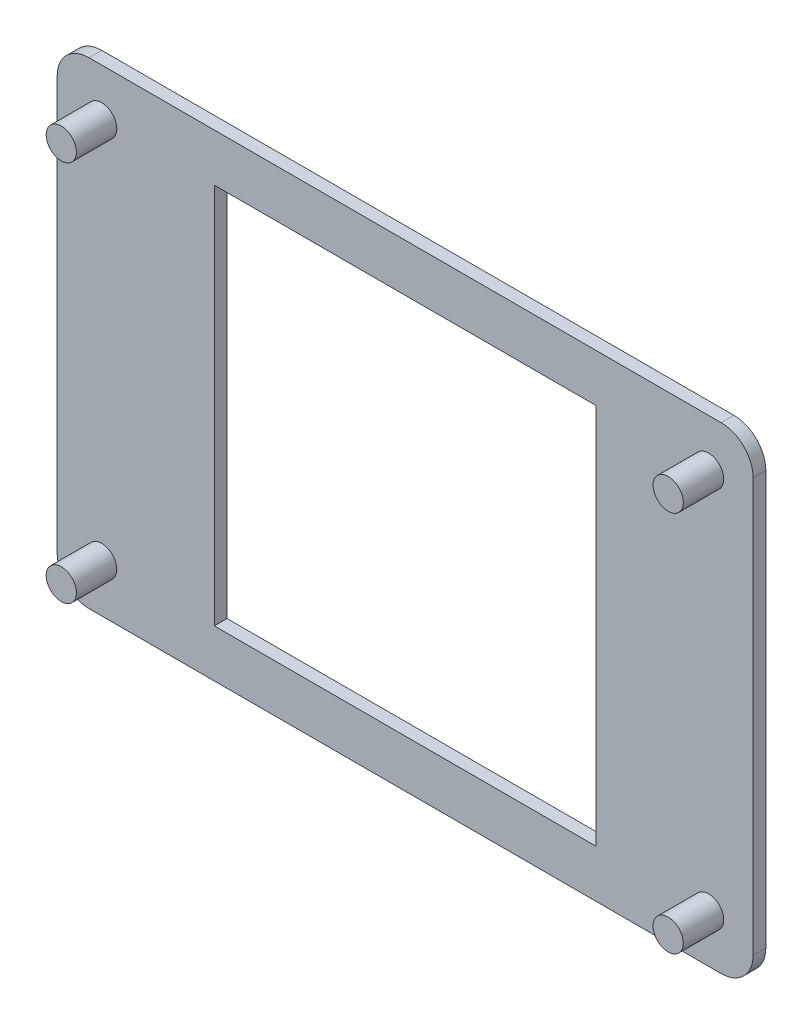
ISO-10303-21;
HEADER;
FILE_DESCRIPTION(('STEP AP214'),'2;1');
FILE_NAME('part.step','',(''),(''),'','','');
FILE_SCHEMA(('AUTOMOTIVE_DESIGN { 1 0 10303 214 1 1 1 1 }'));
ENDSEC;
DATA;
#1=APPLICATION_CONTEXT('core data for automotive mechanical design processes');
#2=APPLICATION_PROTOCOL_DEFINITION('international standard','automotive_design',2000,#1);
#3=PRODUCT_CONTEXT('',#1,'mechanical');
#4=PRODUCT('Part','Part','',(#3));
#5=PRODUCT_RELATED_PRODUCT_CATEGORY('part','',(#4));
#6=PRODUCT_DEFINITION_FORMATION('','',#4);
#7=PRODUCT_DEFINITION_CONTEXT('part definition',#1,'design');
#8=PRODUCT_DEFINITION('design','',#6,#7);
#9=PRODUCT_DEFINITION_SHAPE('','',#8);
#10=(LENGTH_UNIT() NAMED_UNIT(*) SI_UNIT(.MILLI.,.METRE.));
#11=(NAMED_UNIT(*) PLANE_ANGLE_UNIT() SI_UNIT($,.RADIAN.));
#12=(NAMED_UNIT(*) SI_UNIT($,.STERADIAN.) SOLID_ANGLE_UNIT());
#13=UNCERTAINTY_MEASURE_WITH_UNIT(LENGTH_MEASURE(1.E-05),#10,'distance_accuracy_value','');
#14=(GEOMETRIC_REPRESENTATION_CONTEXT(3) GLOBAL_UNCERTAINTY_ASSIGNED_CONTEXT((#13)) GLOBAL_UNIT_ASSIGNED_CONTEXT((#10,
#11,#12)) REPRESENTATION_CONTEXT('',''));
#15=CARTESIAN_POINT('',(0.,0.,0.));
#16=DIRECTION('',(0.,0.,1.));
#17=DIRECTION('',(1.,0.,0.));
#18=AXIS2_PLACEMENT_3D('',#15,#16,#17);
#19=CARTESIAN_POINT('',(0.,0.,2.));
#20=DIRECTION('',(1.,0.,0.));
#21=DIRECTION('',(0.,0.,-1.));
#22=AXIS2_PLACEMENT_3D('',#19,#20,#21);
#23=PLANE('',#22);
#24=DIRECTION('',(0.,-1.,0.));
#25=VECTOR('',#24,1.);
#26=CARTESIAN_POINT('',(0.,0.,0.));
#27=LINE('',#26,#25);
#28=CARTESIAN_POINT('',(0.,70.,0.));
#29=VERTEX_POINT('',#28);
#30=CARTESIAN_POINT('',(0.,5.,0.));
#31=VERTEX_POINT('',#30);
#32=EDGE_CURVE('E177',#29,#31,#27,.T.);
#33=ORIENTED_EDGE('',*,*,#32,.T.);
#34=DIRECTION('',(0.,0.,-1.));
#35=VECTOR('',#34,1.);
#36=CARTESIAN_POINT('',(0.,5.,2.));
#37=LINE('',#36,#35);
#38=CARTESIAN_POINT('',(0.,5.,2.));
#39=VERTEX_POINT('',#38);
#40=EDGE_CURVE('E11',#31,#39,#37,.F.);
#41=ORIENTED_EDGE('',*,*,#40,.T.);
#42=DIRECTION('',(0.,-1.,0.));
#43=VECTOR('',#42,1.);
#44=CARTESIAN_POINT('',(0.,0.,2.));
#45=LINE('',#44,#43);
#46=CARTESIAN_POINT('',(0.,70.,2.));
#47=VERTEX_POINT('',#46);
#48=EDGE_CURVE('E178',#47,#39,#45,.T.);
#49=ORIENTED_EDGE('',*,*,#48,.F.);
#50=DIRECTION('',(0.,0.,-1.));
#51=VECTOR('',#50,1.);
#52=CARTESIAN_POINT('',(0.,70.,2.));
#53=LINE('',#52,#51);
#54=EDGE_CURVE('E41',#47,#29,#53,.T.);
#55=ORIENTED_EDGE('',*,*,#54,.T.);
#56=EDGE_LOOP('',(#33,#41,#49,#55));
#57=FACE_BOUND('',#56,.T.);
#58=ADVANCED_FACE('F33',(#57),#23,.F.);
#59=CARTESIAN_POINT('',(0.,0.,2.));
#60=DIRECTION('',(0.,1.,0.));
#61=DIRECTION('',(0.,0.,1.));
#62=AXIS2_PLACEMENT_3D('',#59,#60,#61);
#63=PLANE('',#62);
#64=DIRECTION('',(1.,0.,0.));
#65=VECTOR('',#64,1.);
#66=CARTESIAN_POINT('',(0.,0.,0.));
#67=LINE('',#66,#65);
#68=CARTESIAN_POINT('',(5.,0.,0.));
#69=VERTEX_POINT('',#68);
#70=CARTESIAN_POINT('',(104.3978,0.,0.));
#71=VERTEX_POINT('',#70);
#72=EDGE_CURVE('E192',#69,#71,#67,.T.);
#73=ORIENTED_EDGE('',*,*,#72,.T.);
#74=DIRECTION('',(0.,0.,-1.));
#75=VECTOR('',#74,1.);
#76=CARTESIAN_POINT('',(104.3978,0.,2.));
#77=LINE('',#76,#75);
#78=CARTESIAN_POINT('',(104.3978,0.,2.));
#79=VERTEX_POINT('',#78);
#80=EDGE_CURVE('E48',#71,#79,#77,.F.);
#81=ORIENTED_EDGE('',*,*,#80,.T.);
#82=DIRECTION('',(1.,0.,0.));
#83=VECTOR('',#82,1.);
#84=CARTESIAN_POINT('',(0.,0.,2.));
#85=LINE('',#84,#83);
#86=CARTESIAN_POINT('',(5.,0.,2.));
#87=VERTEX_POINT('',#86);
#88=EDGE_CURVE('E180',#87,#79,#85,.T.);
#89=ORIENTED_EDGE('',*,*,#88,.F.);
#90=DIRECTION('',(0.,0.,-1.));
#91=VECTOR('',#90,1.);
#92=CARTESIAN_POINT('',(5.,0.,2.));
#93=LINE('',#92,#91);
#94=EDGE_CURVE('E235',#87,#69,#93,.T.);
#95=ORIENTED_EDGE('',*,*,#94,.T.);
#96=EDGE_LOOP('',(#73,#81,#89,#95));
#97=FACE_BOUND('',#96,.T.);
#98=ADVANCED_FACE('F251',(#97),#63,.F.);
#99=CARTESIAN_POINT('',(109.3978,0.,2.));
#100=DIRECTION('',(-1.,0.,0.));
#101=DIRECTION('',(0.,0.,1.));
#102=AXIS2_PLACEMENT_3D('',#99,#100,#101);
#103=PLANE('',#102);
#104=DIRECTION('',(0.,1.,0.));
#105=VECTOR('',#104,1.);
#106=CARTESIAN_POINT('',(109.3978,0.,0.));
#107=LINE('',#106,#105);
#108=CARTESIAN_POINT('',(109.3978,5.,0.));
#109=VERTEX_POINT('',#108);
#110=CARTESIAN_POINT('',(109.3978,70.,0.));
#111=VERTEX_POINT('',#110);
#112=EDGE_CURVE('E194',#109,#111,#107,.T.);
#113=ORIENTED_EDGE('',*,*,#112,.T.);
#114=DIRECTION('',(0.,0.,-1.));
#115=VECTOR('',#114,1.);
#116=CARTESIAN_POINT('',(109.3978,70.,2.));
#117=LINE('',#116,#115);
#118=CARTESIAN_POINT('',(109.3978,70.,2.));
#119=VERTEX_POINT('',#118);
#120=EDGE_CURVE('E226',#111,#119,#117,.F.);
#121=ORIENTED_EDGE('',*,*,#120,.T.);
#122=DIRECTION('',(0.,1.,0.));
#123=VECTOR('',#122,1.);
#124=CARTESIAN_POINT('',(109.3978,0.,2.));
#125=LINE('',#124,#123);
#126=CARTESIAN_POINT('',(109.3978,5.,2.));
#127=VERTEX_POINT('',#126);
#128=EDGE_CURVE('E183',#127,#119,#125,.T.);
#129=ORIENTED_EDGE('',*,*,#128,.F.);
#130=DIRECTION('',(0.,0.,-1.));
#131=VECTOR('',#130,1.);
#132=CARTESIAN_POINT('',(109.3978,5.,2.));
#133=LINE('',#132,#131);
#134=EDGE_CURVE('E223',#127,#109,#133,.T.);
#135=ORIENTED_EDGE('',*,*,#134,.T.);
#136=EDGE_LOOP('',(#113,#121,#129,#135));
#137=FACE_BOUND('',#136,.T.);
#138=ADVANCED_FACE('F260',(#137),#103,.F.);
#139=CARTESIAN_POINT('',(0.,75.,2.));
#140=DIRECTION('',(0.,-1.,0.));
#141=DIRECTION('',(0.,0.,-1.));
#142=AXIS2_PLACEMENT_3D('',#139,#140,#141);
#143=PLANE('',#142);
#144=DIRECTION('',(-1.,0.,0.));
#145=VECTOR('',#144,1.);
#146=CARTESIAN_POINT('',(0.,75.,2.));
#147=LINE('',#146,#145);
#148=CARTESIAN_POINT('',(104.3978,75.,2.));
#149=VERTEX_POINT('',#148);
#150=CARTESIAN_POINT('',(5.,75.,2.));
#151=VERTEX_POINT('',#150);
#152=EDGE_CURVE('E186',#149,#151,#147,.T.);
#153=ORIENTED_EDGE('',*,*,#152,.F.);
#154=DIRECTION('',(0.,0.,-1.));
#155=VECTOR('',#154,1.);
#156=CARTESIAN_POINT('',(104.3978,75.,2.));
#157=LINE('',#156,#155);
#158=CARTESIAN_POINT('',(104.3978,75.,0.));
#159=VERTEX_POINT('',#158);
#160=EDGE_CURVE('E212',#149,#159,#157,.T.);
#161=ORIENTED_EDGE('',*,*,#160,.T.);
#162=DIRECTION('',(-1.,0.,0.));
#163=VECTOR('',#162,1.);
#164=CARTESIAN_POINT('',(0.,75.,0.));
#165=LINE('',#164,#163);
#166=CARTESIAN_POINT('',(5.,75.,0.));
#167=VERTEX_POINT('',#166);
#168=EDGE_CURVE('E181',#159,#167,#165,.T.);
#169=ORIENTED_EDGE('',*,*,#168,.T.);
#170=DIRECTION('',(0.,0.,-1.));
#171=VECTOR('',#170,1.);
#172=CARTESIAN_POINT('',(5.,75.,2.));
#173=LINE('',#172,#171);
#174=EDGE_CURVE('E210',#167,#151,#173,.F.);
#175=ORIENTED_EDGE('',*,*,#174,.T.);
#176=EDGE_LOOP('',(#153,#161,#169,#175));
#177=FACE_BOUND('',#176,.T.);
#178=ADVANCED_FACE('F268',(#177),#143,.F.);
#179=CARTESIAN_POINT('',(0.,0.,2.));
#180=DIRECTION('',(0.,0.,-1.));
#181=DIRECTION('',(-1.,0.,0.));
#182=AXIS2_PLACEMENT_3D('',#179,#180,#181);
#183=PLANE('',#182);
#184=DIRECTION('',(-1.,0.,0.));
#185=VECTOR('',#184,1.);
#186=CARTESIAN_POINT('',(24.6989,67.5,2.));
#187=LINE('',#186,#185);
#188=CARTESIAN_POINT('',(84.6989,67.5,2.));
#189=VERTEX_POINT('',#188);
#190=CARTESIAN_POINT('',(24.6989,67.5,2.));
#191=VERTEX_POINT('',#190);
#192=EDGE_CURVE('E150',#189,#191,#187,.T.);
#193=ORIENTED_EDGE('',*,*,#192,.F.);
#194=DIRECTION('',(0.,1.,0.));
#195=VECTOR('',#194,1.);
#196=CARTESIAN_POINT('',(84.6989,7.50000000000001,2.));
#197=LINE('',#196,#195);
#198=CARTESIAN_POINT('',(84.6989,7.50000000000001,2.));
#199=VERTEX_POINT('',#198);
#200=EDGE_CURVE('E142',#199,#189,#197,.T.);
#201=ORIENTED_EDGE('',*,*,#200,.F.);
#202=DIRECTION('',(1.,0.,0.));
#203=VECTOR('',#202,1.);
#204=CARTESIAN_POINT('',(24.6989,7.50000000000001,2.));
#205=LINE('',#204,#203);
#206=CARTESIAN_POINT('',(24.6989,7.50000000000001,2.));
#207=VERTEX_POINT('',#206);
#208=EDGE_CURVE('E143',#207,#199,#205,.T.);
#209=ORIENTED_EDGE('',*,*,#208,.F.);
#210=DIRECTION('',(0.,-1.,0.));
#211=VECTOR('',#210,1.);
#212=CARTESIAN_POINT('',(24.6989,7.50000000000001,2.));
#213=LINE('',#212,#211);
#214=EDGE_CURVE('E157',#191,#207,#213,.T.);
#215=ORIENTED_EDGE('',*,*,#214,.F.);
#216=EDGE_LOOP('',(#193,#201,#209,#215));
#217=FACE_BOUND('',#216,.T.);
#218=CARTESIAN_POINT('',(6.9977,7.5026,2.));
#219=DIRECTION('',(0.,0.,-1.));
#220=DIRECTION('',(-1.,0.,0.));
#221=AXIS2_PLACEMENT_3D('',#218,#219,#220);
#222=CIRCLE('',#221,2.375);
#223=CARTESIAN_POINT('',(4.6227,7.5026,2.));
#224=VERTEX_POINT('',#223);
#225=EDGE_CURVE('E207',#224,#224,#222,.F.);
#226=ORIENTED_EDGE('',*,*,#225,.F.);
#227=EDGE_LOOP('',(#226));
#228=FACE_BOUND('',#227,.T.);
#229=CARTESIAN_POINT('',(102.4001,7.50260000000001,2.));
#230=DIRECTION('',(0.,0.,-1.));
#231=DIRECTION('',(-1.,0.,0.));
#232=AXIS2_PLACEMENT_3D('',#229,#230,#231);
#233=CIRCLE('',#232,2.375);
#234=CARTESIAN_POINT('',(100.0251,7.50260000000001,2.));
#235=VERTEX_POINT('',#234);
#236=EDGE_CURVE('E204',#235,#235,#233,.F.);
#237=ORIENTED_EDGE('',*,*,#236,.F.);
#238=EDGE_LOOP('',(#237));
#239=FACE_BOUND('',#238,.T.);
#240=CARTESIAN_POINT('',(102.4001,67.4974,2.));
#241=DIRECTION('',(0.,0.,-1.));
#242=DIRECTION('',(-1.,0.,0.));
#243=AXIS2_PLACEMENT_3D('',#240,#241,#242);
#244=CIRCLE('',#243,2.375);
#245=CARTESIAN_POINT('',(100.0251,67.4974,2.));
#246=VERTEX_POINT('',#245);
#247=EDGE_CURVE('E201',#246,#246,#244,.F.);
#248=ORIENTED_EDGE('',*,*,#247,.F.);
#249=EDGE_LOOP('',(#248));
#250=FACE_BOUND('',#249,.T.);
#251=CARTESIAN_POINT('',(6.9977,67.4974,2.));
#252=DIRECTION('',(0.,0.,-1.));
#253=DIRECTION('',(-1.,0.,0.));
#254=AXIS2_PLACEMENT_3D('',#251,#252,#253);
#255=CIRCLE('',#254,2.375);
#256=CARTESIAN_POINT('',(4.6227,67.4974,2.));
#257=VERTEX_POINT('',#256);
#258=EDGE_CURVE('E189',#257,#257,#255,.F.);
#259=ORIENTED_EDGE('',*,*,#258,.F.);
#260=EDGE_LOOP('',(#259));
#261=FACE_BOUND('',#260,.T.);
#262=ORIENTED_EDGE('',*,*,#128,.T.);
#263=CARTESIAN_POINT('',(104.3978,70.,2.));
#264=DIRECTION('',(0.,0.,-1.));
#265=DIRECTION('',(-1.,0.,0.));
#266=AXIS2_PLACEMENT_3D('',#263,#264,#265);
#267=CIRCLE('',#266,5.);
#268=EDGE_CURVE('E233',#119,#149,#267,.F.);
#269=ORIENTED_EDGE('',*,*,#268,.T.);
#270=ORIENTED_EDGE('',*,*,#152,.T.);
#271=CARTESIAN_POINT('',(5.,70.,2.));
#272=DIRECTION('',(0.,0.,-1.));
#273=DIRECTION('',(-1.,0.,0.));
#274=AXIS2_PLACEMENT_3D('',#271,#272,#273);
#275=CIRCLE('',#274,5.);
#276=EDGE_CURVE('E228',#151,#47,#275,.F.);
#277=ORIENTED_EDGE('',*,*,#276,.T.);
#278=ORIENTED_EDGE('',*,*,#48,.T.);
#279=CARTESIAN_POINT('',(5.,5.,2.));
#280=DIRECTION('',(0.,0.,-1.));
#281=DIRECTION('',(-1.,0.,0.));
#282=AXIS2_PLACEMENT_3D('',#279,#280,#281);
#283=CIRCLE('',#282,5.);
#284=EDGE_CURVE('E55',#39,#87,#283,.F.);
#285=ORIENTED_EDGE('',*,*,#284,.T.);
#286=ORIENTED_EDGE('',*,*,#88,.T.);
#287=CARTESIAN_POINT('',(104.3978,5.,2.));
#288=DIRECTION('',(0.,0.,-1.));
#289=DIRECTION('',(-1.,0.,0.));
#290=AXIS2_PLACEMENT_3D('',#287,#288,#289);
#291=CIRCLE('',#290,5.);
#292=EDGE_CURVE('E231',#79,#127,#291,.F.);
#293=ORIENTED_EDGE('',*,*,#292,.T.);
#294=EDGE_LOOP('',(#262,#269,#270,#277,#278,#285,#286,#293));
#295=FACE_BOUND('',#294,.T.);
#296=ADVANCED_FACE('F253',(#217,#228,#239,#250,#261,#295),#183,.F.);
#297=CARTESIAN_POINT('',(0.,0.,0.));
#298=DIRECTION('',(0.,0.,-1.));
#299=DIRECTION('',(-1.,0.,0.));
#300=AXIS2_PLACEMENT_3D('',#297,#298,#299);
#301=PLANE('',#300);
#302=DIRECTION('',(0.,1.,0.));
#303=VECTOR('',#302,1.);
#304=CARTESIAN_POINT('',(84.6989,7.50000000000001,0.));
#305=LINE('',#304,#303);
#306=CARTESIAN_POINT('',(84.6989,7.50000000000001,0.));
#307=VERTEX_POINT('',#306);
#308=CARTESIAN_POINT('',(84.6989,67.5,0.));
#309=VERTEX_POINT('',#308);
#310=EDGE_CURVE('E139',#307,#309,#305,.T.);
#311=ORIENTED_EDGE('',*,*,#310,.T.);
#312=DIRECTION('',(-1.,0.,0.));
#313=VECTOR('',#312,1.);
#314=CARTESIAN_POINT('',(24.6989,67.5,0.));
#315=LINE('',#314,#313);
#316=CARTESIAN_POINT('',(24.6989,67.5,0.));
#317=VERTEX_POINT('',#316);
#318=EDGE_CURVE('E123',#309,#317,#315,.T.);
#319=ORIENTED_EDGE('',*,*,#318,.T.);
#320=DIRECTION('',(0.,-1.,0.));
#321=VECTOR('',#320,1.);
#322=CARTESIAN_POINT('',(24.6989,7.50000000000001,0.));
#323=LINE('',#322,#321);
#324=CARTESIAN_POINT('',(24.6989,7.50000000000001,0.));
#325=VERTEX_POINT('',#324);
#326=EDGE_CURVE('E152',#317,#325,#323,.T.);
#327=ORIENTED_EDGE('',*,*,#326,.T.);
#328=DIRECTION('',(1.,0.,0.));
#329=VECTOR('',#328,1.);
#330=CARTESIAN_POINT('',(24.6989,7.50000000000001,0.));
#331=LINE('',#330,#329);
#332=EDGE_CURVE('E148',#325,#307,#331,.T.);
#333=ORIENTED_EDGE('',*,*,#332,.T.);
#334=EDGE_LOOP('',(#311,#319,#327,#333));
#335=FACE_BOUND('',#334,.T.);
#336=ORIENTED_EDGE('',*,*,#168,.F.);
#337=CARTESIAN_POINT('',(104.3978,70.,0.));
#338=DIRECTION('',(0.,0.,-1.));
#339=DIRECTION('',(-1.,0.,0.));
#340=AXIS2_PLACEMENT_3D('',#337,#338,#339);
#341=CIRCLE('',#340,5.);
#342=EDGE_CURVE('E221',#159,#111,#341,.T.);
#343=ORIENTED_EDGE('',*,*,#342,.T.);
#344=ORIENTED_EDGE('',*,*,#112,.F.);
#345=CARTESIAN_POINT('',(104.3978,5.,0.));
#346=DIRECTION('',(0.,0.,-1.));
#347=DIRECTION('',(-1.,0.,0.));
#348=AXIS2_PLACEMENT_3D('',#345,#346,#347);
#349=CIRCLE('',#348,5.);
#350=EDGE_CURVE('E219',#109,#71,#349,.T.);
#351=ORIENTED_EDGE('',*,*,#350,.T.);
#352=ORIENTED_EDGE('',*,*,#72,.F.);
#353=CARTESIAN_POINT('',(5.,5.,0.));
#354=DIRECTION('',(0.,0.,-1.));
#355=DIRECTION('',(-1.,0.,0.));
#356=AXIS2_PLACEMENT_3D('',#353,#354,#355);
#357=CIRCLE('',#356,5.);
#358=EDGE_CURVE('E217',#69,#31,#357,.T.);
#359=ORIENTED_EDGE('',*,*,#358,.T.);
#360=ORIENTED_EDGE('',*,*,#32,.F.);
#361=CARTESIAN_POINT('',(5.,70.,0.));
#362=DIRECTION('',(0.,0.,-1.));
#363=DIRECTION('',(-1.,0.,0.));
#364=AXIS2_PLACEMENT_3D('',#361,#362,#363);
#365=CIRCLE('',#364,5.);
#366=EDGE_CURVE('E215',#29,#167,#365,.T.);
#367=ORIENTED_EDGE('',*,*,#366,.T.);
#368=EDGE_LOOP('',(#336,#343,#344,#351,#352,#359,#360,#367));
#369=FACE_BOUND('',#368,.T.);
#370=ADVANCED_FACE('F146',(#335,#369),#301,.T.);
#371=CARTESIAN_POINT('',(6.9977,67.4974,8.35));
#372=DIRECTION('',(0.,0.,-1.));
#373=DIRECTION('',(-1.,0.,0.));
#374=AXIS2_PLACEMENT_3D('',#371,#372,#373);
#375=CYLINDRICAL_SURFACE('',#374,2.375);
#376=CARTESIAN_POINT('',(6.9977,67.4974,8.35));
#377=DIRECTION('',(0.,0.,1.));
#378=DIRECTION('',(1.,0.,0.));
#379=AXIS2_PLACEMENT_3D('',#376,#377,#378);
#380=CIRCLE('',#379,2.375);
#381=CARTESIAN_POINT('',(9.37270000000001,67.4974,8.35));
#382=VERTEX_POINT('',#381);
#383=EDGE_CURVE('E174',#382,#382,#380,.T.);
#384=ORIENTED_EDGE('',*,*,#383,.F.);
#385=EDGE_LOOP('',(#384));
#386=FACE_BOUND('',#385,.T.);
#387=ORIENTED_EDGE('',*,*,#258,.T.);
#388=EDGE_LOOP('',(#387));
#389=FACE_BOUND('',#388,.T.);
#390=ADVANCED_FACE('F401',(#386,#389),#375,.T.);
#391=CARTESIAN_POINT('',(6.9977,67.4974,8.35));
#392=DIRECTION('',(0.,0.,1.));
#393=DIRECTION('',(1.,0.,0.));
#394=AXIS2_PLACEMENT_3D('',#391,#392,#393);
#395=PLANE('',#394);
#396=ORIENTED_EDGE('',*,*,#383,.T.);
#397=EDGE_LOOP('',(#396));
#398=FACE_BOUND('',#397,.T.);
#399=ADVANCED_FACE('F392',(#398),#395,.T.);
#400=CARTESIAN_POINT('',(102.4001,67.4974,8.35));
#401=DIRECTION('',(0.,0.,-1.));
#402=DIRECTION('',(-1.,0.,0.));
#403=AXIS2_PLACEMENT_3D('',#400,#401,#402);
#404=CYLINDRICAL_SURFACE('',#403,2.375);
#405=CARTESIAN_POINT('',(102.4001,67.4974,8.35));
#406=DIRECTION('',(0.,0.,1.));
#407=DIRECTION('',(-1.,0.,0.));
#408=AXIS2_PLACEMENT_3D('',#405,#406,#407);
#409=CIRCLE('',#408,2.375);
#410=CARTESIAN_POINT('',(100.0251,67.4974,8.35));
#411=VERTEX_POINT('',#410);
#412=EDGE_CURVE('E171',#411,#411,#409,.T.);
#413=ORIENTED_EDGE('',*,*,#412,.F.);
#414=EDGE_LOOP('',(#413));
#415=FACE_BOUND('',#414,.T.);
#416=ORIENTED_EDGE('',*,*,#247,.T.);
#417=EDGE_LOOP('',(#416));
#418=FACE_BOUND('',#417,.T.);
#419=ADVANCED_FACE('F383',(#415,#418),#404,.T.);
#420=CARTESIAN_POINT('',(102.4001,67.4974,8.35));
#421=DIRECTION('',(0.,0.,-1.));
#422=DIRECTION('',(-1.,0.,0.));
#423=AXIS2_PLACEMENT_3D('',#420,#421,#422);
#424=PLANE('',#423);
#425=ORIENTED_EDGE('',*,*,#412,.T.);
#426=EDGE_LOOP('',(#425));
#427=FACE_BOUND('',#426,.T.);
#428=ADVANCED_FACE('F374',(#427),#424,.F.);
#429=CARTESIAN_POINT('',(102.4001,7.50260000000001,8.35));
#430=DIRECTION('',(0.,0.,-1.));
#431=DIRECTION('',(-1.,0.,0.));
#432=AXIS2_PLACEMENT_3D('',#429,#430,#431);
#433=CYLINDRICAL_SURFACE('',#432,2.375);
#434=CARTESIAN_POINT('',(102.4001,7.50260000000001,8.35));
#435=DIRECTION('',(0.,0.,1.));
#436=DIRECTION('',(1.,0.,0.));
#437=AXIS2_PLACEMENT_3D('',#434,#435,#436);
#438=CIRCLE('',#437,2.375);
#439=CARTESIAN_POINT('',(104.7751,7.50260000000001,8.35));
#440=VERTEX_POINT('',#439);
#441=EDGE_CURVE('E168',#440,#440,#438,.T.);
#442=ORIENTED_EDGE('',*,*,#441,.F.);
#443=EDGE_LOOP('',(#442));
#444=FACE_BOUND('',#443,.T.);
#445=ORIENTED_EDGE('',*,*,#236,.T.);
#446=EDGE_LOOP('',(#445));
#447=FACE_BOUND('',#446,.T.);
#448=ADVANCED_FACE('F365',(#444,#447),#433,.T.);
#449=CARTESIAN_POINT('',(102.4001,7.50260000000001,8.35));
#450=DIRECTION('',(0.,0.,1.));
#451=DIRECTION('',(1.,0.,0.));
#452=AXIS2_PLACEMENT_3D('',#449,#450,#451);
#453=PLANE('',#452);
#454=ORIENTED_EDGE('',*,*,#441,.T.);
#455=EDGE_LOOP('',(#454));
#456=FACE_BOUND('',#455,.T.);
#457=ADVANCED_FACE('F356',(#456),#453,.T.);
#458=CARTESIAN_POINT('',(6.9977,7.5026,8.35));
#459=DIRECTION('',(0.,0.,-1.));
#460=DIRECTION('',(-1.,0.,0.));
#461=AXIS2_PLACEMENT_3D('',#458,#459,#460);
#462=CYLINDRICAL_SURFACE('',#461,2.375);
#463=CARTESIAN_POINT('',(6.9977,7.5026,8.35));
#464=DIRECTION('',(0.,0.,1.));
#465=DIRECTION('',(-1.,0.,0.));
#466=AXIS2_PLACEMENT_3D('',#463,#464,#465);
#467=CIRCLE('',#466,2.375);
#468=CARTESIAN_POINT('',(4.6227,7.5026,8.35));
#469=VERTEX_POINT('',#468);
#470=EDGE_CURVE('E134',#469,#469,#467,.T.);
#471=ORIENTED_EDGE('',*,*,#470,.F.);
#472=EDGE_LOOP('',(#471));
#473=FACE_BOUND('',#472,.T.);
#474=ORIENTED_EDGE('',*,*,#225,.T.);
#475=EDGE_LOOP('',(#474));
#476=FACE_BOUND('',#475,.T.);
#477=ADVANCED_FACE('F347',(#473,#476),#462,.T.);
#478=CARTESIAN_POINT('',(6.9977,7.5026,8.35));
#479=DIRECTION('',(0.,0.,-1.));
#480=DIRECTION('',(-1.,0.,0.));
#481=AXIS2_PLACEMENT_3D('',#478,#479,#480);
#482=PLANE('',#481);
#483=ORIENTED_EDGE('',*,*,#470,.T.);
#484=EDGE_LOOP('',(#483));
#485=FACE_BOUND('',#484,.T.);
#486=ADVANCED_FACE('F339',(#485),#482,.F.);
#487=CARTESIAN_POINT('',(84.6989,7.50000000000001,-0.00100000000000013));
#488=DIRECTION('',(1.,0.,0.));
#489=DIRECTION('',(0.,0.,-1.));
#490=AXIS2_PLACEMENT_3D('',#487,#488,#489);
#491=PLANE('',#490);
#492=DIRECTION('',(0.,0.,1.));
#493=VECTOR('',#492,1.);
#494=CARTESIAN_POINT('',(84.6989,7.50000000000001,-0.00100000000000013));
#495=LINE('',#494,#493);
#496=EDGE_CURVE('E135',#307,#199,#495,.T.);
#497=ORIENTED_EDGE('',*,*,#496,.T.);
#498=ORIENTED_EDGE('',*,*,#200,.T.);
#499=DIRECTION('',(0.,0.,1.));
#500=VECTOR('',#499,1.);
#501=CARTESIAN_POINT('',(84.6989,67.5,-0.00100000000000013));
#502=LINE('',#501,#500);
#503=EDGE_CURVE('E127',#309,#189,#502,.T.);
#504=ORIENTED_EDGE('',*,*,#503,.F.);
#505=ORIENTED_EDGE('',*,*,#310,.F.);
#506=EDGE_LOOP('',(#497,#498,#504,#505));
#507=FACE_BOUND('',#506,.T.);
#508=ADVANCED_FACE('F138',(#507),#491,.F.);
#509=CARTESIAN_POINT('',(24.6989,7.50000000000001,-0.00100000000000013));
#510=DIRECTION('',(0.,-1.,0.));
#511=DIRECTION('',(0.,0.,-1.));
#512=AXIS2_PLACEMENT_3D('',#509,#510,#511);
#513=PLANE('',#512);
#514=DIRECTION('',(0.,0.,1.));
#515=VECTOR('',#514,1.);
#516=CARTESIAN_POINT('',(24.6989,7.50000000000001,-0.00100000000000013));
#517=LINE('',#516,#515);
#518=EDGE_CURVE('E163',#325,#207,#517,.T.);
#519=ORIENTED_EDGE('',*,*,#518,.T.);
#520=ORIENTED_EDGE('',*,*,#208,.T.);
#521=ORIENTED_EDGE('',*,*,#496,.F.);
#522=ORIENTED_EDGE('',*,*,#332,.F.);
#523=EDGE_LOOP('',(#519,#520,#521,#522));
#524=FACE_BOUND('',#523,.T.);
#525=ADVANCED_FACE('F322',(#524),#513,.F.);
#526=CARTESIAN_POINT('',(24.6989,7.50000000000001,-0.00100000000000013));
#527=DIRECTION('',(-1.,0.,0.));
#528=DIRECTION('',(0.,0.,1.));
#529=AXIS2_PLACEMENT_3D('',#526,#527,#528);
#530=PLANE('',#529);
#531=DIRECTION('',(0.,0.,1.));
#532=VECTOR('',#531,1.);
#533=CARTESIAN_POINT('',(24.6989,67.5,-0.00100000000000013));
#534=LINE('',#533,#532);
#535=EDGE_CURVE('E129',#317,#191,#534,.T.);
#536=ORIENTED_EDGE('',*,*,#535,.T.);
#537=ORIENTED_EDGE('',*,*,#214,.T.);
#538=ORIENTED_EDGE('',*,*,#518,.F.);
#539=ORIENTED_EDGE('',*,*,#326,.F.);
#540=EDGE_LOOP('',(#536,#537,#538,#539));
#541=FACE_BOUND('',#540,.T.);
#542=ADVANCED_FACE('F314',(#541),#530,.F.);
#543=CARTESIAN_POINT('',(24.6989,67.5,-0.00100000000000013));
#544=DIRECTION('',(0.,1.,0.));
#545=DIRECTION('',(0.,0.,1.));
#546=AXIS2_PLACEMENT_3D('',#543,#544,#545);
#547=PLANE('',#546);
#548=ORIENTED_EDGE('',*,*,#503,.T.);
#549=ORIENTED_EDGE('',*,*,#192,.T.);
#550=ORIENTED_EDGE('',*,*,#535,.F.);
#551=ORIENTED_EDGE('',*,*,#318,.F.);
#552=EDGE_LOOP('',(#548,#549,#550,#551));
#553=FACE_BOUND('',#552,.T.);
#554=ADVANCED_FACE('F125',(#553),#547,.F.);
#555=CARTESIAN_POINT('',(104.3978,70.,2.));
#556=DIRECTION('',(0.,0.,-1.));
#557=DIRECTION('',(-1.,0.,0.));
#558=AXIS2_PLACEMENT_3D('',#555,#556,#557);
#559=CYLINDRICAL_SURFACE('',#558,5.);
#560=ORIENTED_EDGE('',*,*,#268,.F.);
#561=ORIENTED_EDGE('',*,*,#120,.F.);
#562=ORIENTED_EDGE('',*,*,#342,.F.);
#563=ORIENTED_EDGE('',*,*,#160,.F.);
#564=EDGE_LOOP('',(#560,#561,#562,#563));
#565=FACE_BOUND('',#564,.T.);
#566=ADVANCED_FACE('F265',(#565),#559,.T.);
#567=CARTESIAN_POINT('',(104.3978,5.,2.));
#568=DIRECTION('',(0.,0.,-1.));
#569=DIRECTION('',(-1.,0.,0.));
#570=AXIS2_PLACEMENT_3D('',#567,#568,#569);
#571=CYLINDRICAL_SURFACE('',#570,5.);
#572=ORIENTED_EDGE('',*,*,#292,.F.);
#573=ORIENTED_EDGE('',*,*,#80,.F.);
#574=ORIENTED_EDGE('',*,*,#350,.F.);
#575=ORIENTED_EDGE('',*,*,#134,.F.);
#576=EDGE_LOOP('',(#572,#573,#574,#575));
#577=FACE_BOUND('',#576,.T.);
#578=ADVANCED_FACE('F257',(#577),#571,.T.);
#579=CARTESIAN_POINT('',(5.,5.,2.));
#580=DIRECTION('',(0.,0.,-1.));
#581=DIRECTION('',(-1.,0.,0.));
#582=AXIS2_PLACEMENT_3D('',#579,#580,#581);
#583=CYLINDRICAL_SURFACE('',#582,5.);
#584=ORIENTED_EDGE('',*,*,#284,.F.);
#585=ORIENTED_EDGE('',*,*,#40,.F.);
#586=ORIENTED_EDGE('',*,*,#358,.F.);
#587=ORIENTED_EDGE('',*,*,#94,.F.);
#588=EDGE_LOOP('',(#584,#585,#586,#587));
#589=FACE_BOUND('',#588,.T.);
#590=ADVANCED_FACE('F250',(#589),#583,.T.);
#591=CARTESIAN_POINT('',(5.,70.,2.));
#592=DIRECTION('',(0.,0.,-1.));
#593=DIRECTION('',(-1.,0.,0.));
#594=AXIS2_PLACEMENT_3D('',#591,#592,#593);
#595=CYLINDRICAL_SURFACE('',#594,5.);
#596=ORIENTED_EDGE('',*,*,#276,.F.);
#597=ORIENTED_EDGE('',*,*,#174,.F.);
#598=ORIENTED_EDGE('',*,*,#366,.F.);
#599=ORIENTED_EDGE('',*,*,#54,.F.);
#600=EDGE_LOOP('',(#596,#597,#598,#599));
#601=FACE_BOUND('',#600,.T.);
#602=ADVANCED_FACE('F35',(#601),#595,.T.);
#603=CLOSED_SHELL('',(#58,#98,#138,#178,#296,#370,#390,#399,#419,#428,#448,#457,#477,#486,#508,
#525,#542,#554,#566,#578,#590,#602));
#604=MANIFOLD_SOLID_BREP('B2',#603);
#605=ADVANCED_BREP_SHAPE_REPRESENTATION('',(#18,#604),#14);
#606=SHAPE_DEFINITION_REPRESENTATION(#9,#605);
ENDSEC;
END-ISO-10303-21;
